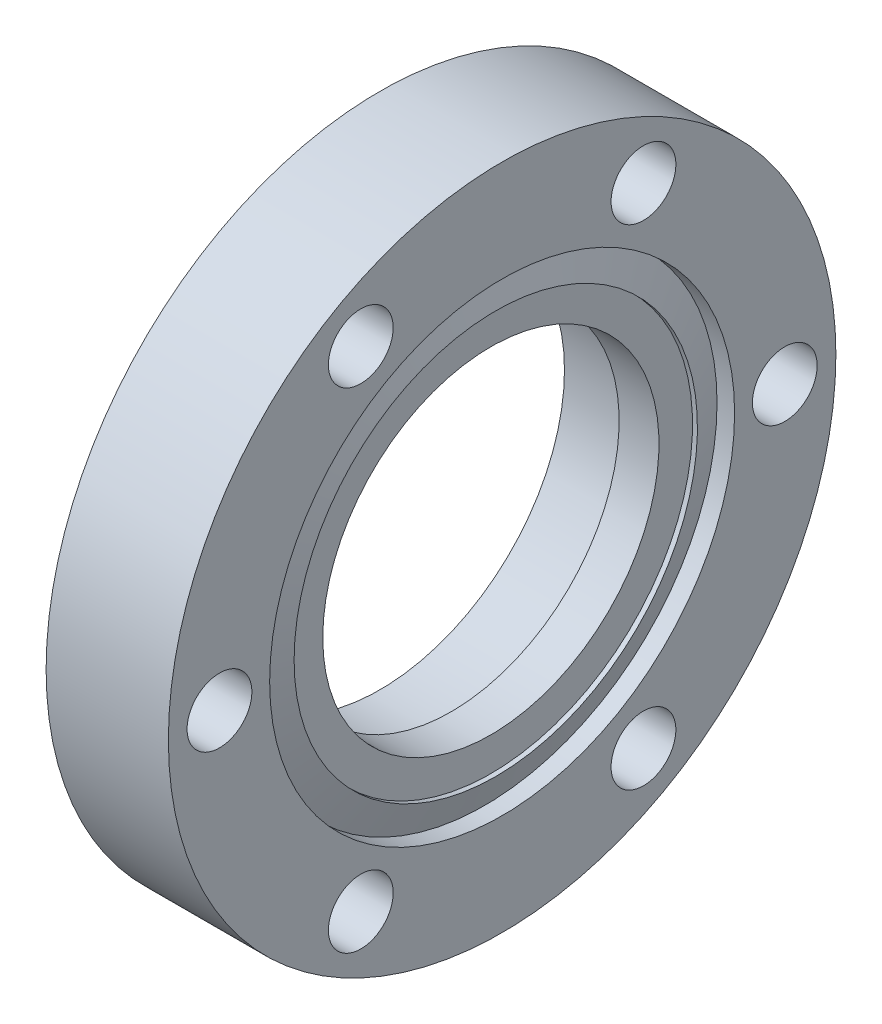
ISO-10303-21;
HEADER;
FILE_DESCRIPTION(('STEP AP214'),'2;1');
FILE_NAME('part.step','',(''),(''),'','','');
FILE_SCHEMA(('AUTOMOTIVE_DESIGN { 1 0 10303 214 1 1 1 1 }'));
ENDSEC;
DATA;
#1=APPLICATION_CONTEXT('core data for automotive mechanical design processes');
#2=APPLICATION_PROTOCOL_DEFINITION('international standard','automotive_design',2000,#1);
#3=PRODUCT_CONTEXT('',#1,'mechanical');
#4=PRODUCT('Part','Part','',(#3));
#5=PRODUCT_RELATED_PRODUCT_CATEGORY('part','',(#4));
#6=PRODUCT_DEFINITION_FORMATION('','',#4);
#7=PRODUCT_DEFINITION_CONTEXT('part definition',#1,'design');
#8=PRODUCT_DEFINITION('design','',#6,#7);
#9=PRODUCT_DEFINITION_SHAPE('','',#8);
#10=(LENGTH_UNIT() NAMED_UNIT(*) SI_UNIT(.MILLI.,.METRE.));
#11=(NAMED_UNIT(*) PLANE_ANGLE_UNIT() SI_UNIT($,.RADIAN.));
#12=(NAMED_UNIT(*) SI_UNIT($,.STERADIAN.) SOLID_ANGLE_UNIT());
#13=UNCERTAINTY_MEASURE_WITH_UNIT(LENGTH_MEASURE(1.E-05),#10,'distance_accuracy_value','');
#14=(GEOMETRIC_REPRESENTATION_CONTEXT(3) GLOBAL_UNCERTAINTY_ASSIGNED_CONTEXT((#13)) GLOBAL_UNIT_ASSIGNED_CONTEXT((#10,
#11,#12)) REPRESENTATION_CONTEXT('',''));
#15=CARTESIAN_POINT('',(0.,0.,0.));
#16=DIRECTION('',(0.,0.,1.));
#17=DIRECTION('',(1.,0.,0.));
#18=AXIS2_PLACEMENT_3D('',#15,#16,#17);
#19=CARTESIAN_POINT('',(5.18000000000051,-19.2062500000005,0.));
#20=DIRECTION('',(1.,0.,0.));
#21=DIRECTION('',(0.,0.,-1.));
#22=AXIS2_PLACEMENT_3D('',#19,#20,#21);
#23=PLANE('',#22);
#24=CARTESIAN_POINT('',(5.18000000000051,0.,0.));
#25=DIRECTION('',(-1.,0.,0.));
#26=DIRECTION('',(0.,0.,1.));
#27=AXIS2_PLACEMENT_3D('',#24,#25,#26);
#28=CIRCLE('',#27,17.4625);
#29=CARTESIAN_POINT('',(5.18000000000051,0.,17.4625));
#30=VERTEX_POINT('',#29);
#31=EDGE_CURVE('E18',#30,#30,#28,.T.);
#32=ORIENTED_EDGE('',*,*,#31,.T.);
#33=EDGE_LOOP('',(#32));
#34=FACE_BOUND('',#33,.T.);
#35=CARTESIAN_POINT('',(5.18000000000051,0.,0.));
#36=DIRECTION('',(-1.,0.,0.));
#37=DIRECTION('',(0.,0.,1.));
#38=AXIS2_PLACEMENT_3D('',#35,#36,#37);
#39=CIRCLE('',#38,20.950000000001);
#40=CARTESIAN_POINT('',(5.18000000000051,0.,20.950000000001));
#41=VERTEX_POINT('',#40);
#42=EDGE_CURVE('E81',#41,#41,#39,.F.);
#43=ORIENTED_EDGE('',*,*,#42,.T.);
#44=EDGE_LOOP('',(#43));
#45=FACE_BOUND('',#44,.T.);
#46=ADVANCED_FACE('F14',(#34,#45),#23,.T.);
#47=CARTESIAN_POINT('',(3.11069999999995,0.,0.));
#48=DIRECTION('',(-1.,0.,0.));
#49=DIRECTION('',(0.,0.,1.));
#50=AXIS2_PLACEMENT_3D('',#47,#48,#49);
#51=CYLINDRICAL_SURFACE('',#50,17.4625);
#52=CARTESIAN_POINT('',(1.04139999999939,0.,0.));
#53=DIRECTION('',(-1.,0.,0.));
#54=DIRECTION('',(0.,0.,1.));
#55=AXIS2_PLACEMENT_3D('',#52,#53,#54);
#56=CIRCLE('',#55,17.4625);
#57=CARTESIAN_POINT('',(1.04139999999939,0.,17.4625));
#58=VERTEX_POINT('',#57);
#59=EDGE_CURVE('E79',#58,#58,#56,.F.);
#60=ORIENTED_EDGE('',*,*,#59,.F.);
#61=EDGE_LOOP('',(#60));
#62=FACE_BOUND('',#61,.T.);
#63=ORIENTED_EDGE('',*,*,#31,.F.);
#64=EDGE_LOOP('',(#63));
#65=FACE_BOUND('',#64,.T.);
#66=ADVANCED_FACE('F89',(#62,#65),#51,.F.);
#67=CARTESIAN_POINT('',(5.43499999999988,0.,0.));
#68=DIRECTION('',(-1.,0.,0.));
#69=DIRECTION('',(0.,0.,1.));
#70=AXIS2_PLACEMENT_3D('',#67,#68,#69);
#71=CYLINDRICAL_SURFACE('',#70,20.950000000001);
#72=ORIENTED_EDGE('',*,*,#42,.F.);
#73=EDGE_LOOP('',(#72));
#74=FACE_BOUND('',#73,.T.);
#75=CARTESIAN_POINT('',(5.69000000223288,0.,0.));
#76=DIRECTION('',(-1.,0.,0.));
#77=DIRECTION('',(0.,-1.,0.));
#78=AXIS2_PLACEMENT_3D('',#75,#76,#77);
#79=CIRCLE('',#78,20.950000000814);
#80=CARTESIAN_POINT('',(5.69000000223288,-20.950000000814,0.));
#81=VERTEX_POINT('',#80);
#82=EDGE_CURVE('E78',#81,#81,#79,.T.);
#83=ORIENTED_EDGE('',*,*,#82,.F.);
#84=EDGE_LOOP('',(#83));
#85=FACE_BOUND('',#84,.T.);
#86=ADVANCED_FACE('F91',(#74,#85),#71,.F.);
#87=CARTESIAN_POINT('',(1.04139999999939,-18.3197499999999,0.));
#88=DIRECTION('',(-1.,0.,0.));
#89=DIRECTION('',(0.,0.,1.));
#90=AXIS2_PLACEMENT_3D('',#87,#88,#89);
#91=PLANE('',#90);
#92=ORIENTED_EDGE('',*,*,#59,.T.);
#93=EDGE_LOOP('',(#92));
#94=FACE_BOUND('',#93,.T.);
#95=CARTESIAN_POINT('',(1.04139999999939,0.,0.));
#96=DIRECTION('',(-1.,0.,0.));
#97=DIRECTION('',(0.,0.,1.));
#98=AXIS2_PLACEMENT_3D('',#95,#96,#97);
#99=CIRCLE('',#98,19.1769999999999);
#100=CARTESIAN_POINT('',(1.04139999999939,0.,19.1769999999999));
#101=VERTEX_POINT('',#100);
#102=EDGE_CURVE('E75',#101,#101,#99,.T.);
#103=ORIENTED_EDGE('',*,*,#102,.T.);
#104=EDGE_LOOP('',(#103));
#105=FACE_BOUND('',#104,.T.);
#106=ADVANCED_FACE('F100',(#94,#105),#91,.T.);
#107=CARTESIAN_POINT('',(4.52529524811392,0.,0.));
#108=DIRECTION('',(-1.,0.,0.));
#109=DIRECTION('',(0.,0.,1.));
#110=AXIS2_PLACEMENT_3D('',#107,#108,#109);
#111=CONICAL_SURFACE('',#110,24.1499999991873,1.22173047499998);
#112=ORIENTED_EDGE('',*,*,#82,.T.);
#113=EDGE_LOOP('',(#112));
#114=FACE_BOUND('',#113,.T.);
#115=CARTESIAN_POINT('',(4.52529525034756,0.,0.));
#116=DIRECTION('',(-1.,0.,0.));
#117=DIRECTION('',(0.,0.,1.));
#118=AXIS2_PLACEMENT_3D('',#115,#116,#117);
#119=CIRCLE('',#118,24.1500000000003);
#120=CARTESIAN_POINT('',(4.52529525034756,0.,24.1500000000003));
#121=VERTEX_POINT('',#120);
#122=EDGE_CURVE('E74',#121,#121,#119,.F.);
#123=ORIENTED_EDGE('',*,*,#122,.T.);
#124=EDGE_LOOP('',(#123));
#125=FACE_BOUND('',#124,.T.);
#126=ADVANCED_FACE('F130',(#114,#125),#111,.T.);
#127=CARTESIAN_POINT('',(-2.65429999999995,0.,0.));
#128=DIRECTION('',(-1.,0.,0.));
#129=DIRECTION('',(0.,0.,1.));
#130=AXIS2_PLACEMENT_3D('',#127,#128,#129);
#131=CYLINDRICAL_SURFACE('',#130,19.1769999999999);
#132=CARTESIAN_POINT('',(-6.34999999999929,0.,0.));
#133=DIRECTION('',(-1.,0.,0.));
#134=DIRECTION('',(0.,0.,1.));
#135=AXIS2_PLACEMENT_3D('',#132,#133,#134);
#136=CIRCLE('',#135,19.1769999999999);
#137=CARTESIAN_POINT('',(-6.34999999999929,0.,19.1769999999999));
#138=VERTEX_POINT('',#137);
#139=EDGE_CURVE('E53',#138,#138,#136,.F.);
#140=ORIENTED_EDGE('',*,*,#139,.F.);
#141=EDGE_LOOP('',(#140));
#142=FACE_BOUND('',#141,.T.);
#143=ORIENTED_EDGE('',*,*,#102,.F.);
#144=EDGE_LOOP('',(#143));
#145=FACE_BOUND('',#144,.T.);
#146=ADVANCED_FACE('F126',(#142,#145),#131,.F.);
#147=CARTESIAN_POINT('',(6.34999999999939,-25.4285843160799,14.6811999999998));
#148=DIRECTION('',(-1.,0.,0.));
#149=DIRECTION('',(0.,0.,1.));
#150=AXIS2_PLACEMENT_3D('',#147,#148,#149);
#151=CYLINDRICAL_SURFACE('',#150,3.36550000000002);
#152=CARTESIAN_POINT('',(6.34999999999937,-25.4285843160799,14.6811999999998));
#153=DIRECTION('',(-1.,0.,0.));
#154=DIRECTION('',(0.,0.,1.));
#155=AXIS2_PLACEMENT_3D('',#152,#153,#154);
#156=CIRCLE('',#155,3.36550000000002);
#157=CARTESIAN_POINT('',(6.34999999999937,-25.4285843160799,18.0466999999999));
#158=VERTEX_POINT('',#157);
#159=EDGE_CURVE('E50',#158,#158,#156,.T.);
#160=ORIENTED_EDGE('',*,*,#159,.F.);
#161=EDGE_LOOP('',(#160));
#162=FACE_BOUND('',#161,.T.);
#163=CARTESIAN_POINT('',(-6.34999999999929,-25.4285843160799,14.6811999999998));
#164=DIRECTION('',(-1.,0.,0.));
#165=DIRECTION('',(0.,0.,1.));
#166=AXIS2_PLACEMENT_3D('',#163,#164,#165);
#167=CIRCLE('',#166,3.36550000000002);
#168=CARTESIAN_POINT('',(-6.34999999999929,-25.4285843160799,18.0466999999999));
#169=VERTEX_POINT('',#168);
#170=EDGE_CURVE('E71',#169,#169,#167,.F.);
#171=ORIENTED_EDGE('',*,*,#170,.F.);
#172=EDGE_LOOP('',(#171));
#173=FACE_BOUND('',#172,.T.);
#174=ADVANCED_FACE('F129',(#162,#173),#151,.F.);
#175=CARTESIAN_POINT('',(6.34999999999939,0.,29.3623999999996));
#176=DIRECTION('',(-1.,0.,0.));
#177=DIRECTION('',(0.,0.,1.));
#178=AXIS2_PLACEMENT_3D('',#175,#176,#177);
#179=CYLINDRICAL_SURFACE('',#178,3.3655);
#180=CARTESIAN_POINT('',(6.34999999999937,0.,29.3623999999996));
#181=DIRECTION('',(-1.,0.,0.));
#182=DIRECTION('',(0.,0.,1.));
#183=AXIS2_PLACEMENT_3D('',#180,#181,#182);
#184=CIRCLE('',#183,3.3655);
#185=CARTESIAN_POINT('',(6.34999999999937,0.,32.7278999999996));
#186=VERTEX_POINT('',#185);
#187=EDGE_CURVE('E47',#186,#186,#184,.T.);
#188=ORIENTED_EDGE('',*,*,#187,.F.);
#189=EDGE_LOOP('',(#188));
#190=FACE_BOUND('',#189,.T.);
#191=CARTESIAN_POINT('',(-6.34999999999929,0.,29.3623999999996));
#192=DIRECTION('',(-1.,0.,0.));
#193=DIRECTION('',(0.,0.,1.));
#194=AXIS2_PLACEMENT_3D('',#191,#192,#193);
#195=CIRCLE('',#194,3.3655);
#196=CARTESIAN_POINT('',(-6.34999999999929,0.,32.7278999999996));
#197=VERTEX_POINT('',#196);
#198=EDGE_CURVE('E68',#197,#197,#195,.F.);
#199=ORIENTED_EDGE('',*,*,#198,.F.);
#200=EDGE_LOOP('',(#199));
#201=FACE_BOUND('',#200,.T.);
#202=ADVANCED_FACE('F213',(#190,#201),#179,.F.);
#203=CARTESIAN_POINT('',(6.34999999999939,25.4285843160799,14.6811999999998));
#204=DIRECTION('',(-1.,0.,0.));
#205=DIRECTION('',(0.,0.,1.));
#206=AXIS2_PLACEMENT_3D('',#203,#204,#205);
#207=CYLINDRICAL_SURFACE('',#206,3.36549999999999);
#208=CARTESIAN_POINT('',(6.34999999999937,25.4285843160799,14.6811999999998));
#209=DIRECTION('',(-1.,0.,0.));
#210=DIRECTION('',(0.,0.,1.));
#211=AXIS2_PLACEMENT_3D('',#208,#209,#210);
#212=CIRCLE('',#211,3.36549999999999);
#213=CARTESIAN_POINT('',(6.34999999999937,25.4285843160799,18.0466999999998));
#214=VERTEX_POINT('',#213);
#215=EDGE_CURVE('E44',#214,#214,#212,.T.);
#216=ORIENTED_EDGE('',*,*,#215,.F.);
#217=EDGE_LOOP('',(#216));
#218=FACE_BOUND('',#217,.T.);
#219=CARTESIAN_POINT('',(-6.34999999999929,25.4285843160799,14.6811999999998));
#220=DIRECTION('',(-1.,0.,0.));
#221=DIRECTION('',(0.,0.,1.));
#222=AXIS2_PLACEMENT_3D('',#219,#220,#221);
#223=CIRCLE('',#222,3.36549999999999);
#224=CARTESIAN_POINT('',(-6.34999999999929,25.4285843160799,18.0466999999998));
#225=VERTEX_POINT('',#224);
#226=EDGE_CURVE('E65',#225,#225,#223,.F.);
#227=ORIENTED_EDGE('',*,*,#226,.F.);
#228=EDGE_LOOP('',(#227));
#229=FACE_BOUND('',#228,.T.);
#230=ADVANCED_FACE('F224',(#218,#229),#207,.F.);
#231=CARTESIAN_POINT('',(6.34999999999939,25.4285843160799,-14.6811999999998));
#232=DIRECTION('',(-1.,0.,0.));
#233=DIRECTION('',(0.,0.,1.));
#234=AXIS2_PLACEMENT_3D('',#231,#232,#233);
#235=CYLINDRICAL_SURFACE('',#234,3.3655);
#236=CARTESIAN_POINT('',(6.34999999999937,25.4285843160799,-14.6811999999998));
#237=DIRECTION('',(-1.,0.,0.));
#238=DIRECTION('',(0.,0.,1.));
#239=AXIS2_PLACEMENT_3D('',#236,#237,#238);
#240=CIRCLE('',#239,3.3655);
#241=CARTESIAN_POINT('',(6.34999999999937,25.4285843160799,-11.3156999999998));
#242=VERTEX_POINT('',#241);
#243=EDGE_CURVE('E41',#242,#242,#240,.T.);
#244=ORIENTED_EDGE('',*,*,#243,.F.);
#245=EDGE_LOOP('',(#244));
#246=FACE_BOUND('',#245,.T.);
#247=CARTESIAN_POINT('',(-6.34999999999929,25.4285843160799,-14.6811999999998));
#248=DIRECTION('',(-1.,0.,0.));
#249=DIRECTION('',(0.,0.,1.));
#250=AXIS2_PLACEMENT_3D('',#247,#248,#249);
#251=CIRCLE('',#250,3.3655);
#252=CARTESIAN_POINT('',(-6.34999999999929,25.4285843160799,-11.3156999999998));
#253=VERTEX_POINT('',#252);
#254=EDGE_CURVE('E62',#253,#253,#251,.F.);
#255=ORIENTED_EDGE('',*,*,#254,.F.);
#256=EDGE_LOOP('',(#255));
#257=FACE_BOUND('',#256,.T.);
#258=ADVANCED_FACE('F235',(#246,#257),#235,.F.);
#259=CARTESIAN_POINT('',(6.34999999999939,-25.4285843160799,-14.6811999999998));
#260=DIRECTION('',(-1.,0.,0.));
#261=DIRECTION('',(0.,0.,1.));
#262=AXIS2_PLACEMENT_3D('',#259,#260,#261);
#263=CYLINDRICAL_SURFACE('',#262,3.3655);
#264=CARTESIAN_POINT('',(6.34999999999937,-25.4285843160799,-14.6811999999998));
#265=DIRECTION('',(-1.,0.,0.));
#266=DIRECTION('',(0.,0.,1.));
#267=AXIS2_PLACEMENT_3D('',#264,#265,#266);
#268=CIRCLE('',#267,3.3655);
#269=CARTESIAN_POINT('',(6.34999999999937,-25.4285843160799,-11.3156999999998));
#270=VERTEX_POINT('',#269);
#271=EDGE_CURVE('E38',#270,#270,#268,.T.);
#272=ORIENTED_EDGE('',*,*,#271,.F.);
#273=EDGE_LOOP('',(#272));
#274=FACE_BOUND('',#273,.T.);
#275=CARTESIAN_POINT('',(-6.34999999999929,-25.4285843160799,-14.6811999999998));
#276=DIRECTION('',(-1.,0.,0.));
#277=DIRECTION('',(0.,0.,1.));
#278=AXIS2_PLACEMENT_3D('',#275,#276,#277);
#279=CIRCLE('',#278,3.3655);
#280=CARTESIAN_POINT('',(-6.34999999999929,-25.4285843160799,-11.3156999999998));
#281=VERTEX_POINT('',#280);
#282=EDGE_CURVE('E59',#281,#281,#279,.F.);
#283=ORIENTED_EDGE('',*,*,#282,.F.);
#284=EDGE_LOOP('',(#283));
#285=FACE_BOUND('',#284,.T.);
#286=ADVANCED_FACE('F246',(#274,#285),#263,.F.);
#287=CARTESIAN_POINT('',(6.34999999999939,0.,-29.3623999999996));
#288=DIRECTION('',(-1.,0.,0.));
#289=DIRECTION('',(0.,0.,1.));
#290=AXIS2_PLACEMENT_3D('',#287,#288,#289);
#291=CYLINDRICAL_SURFACE('',#290,3.3655);
#292=CARTESIAN_POINT('',(6.34999999999937,0.,-29.3623999999996));
#293=DIRECTION('',(-1.,0.,0.));
#294=DIRECTION('',(0.,0.,1.));
#295=AXIS2_PLACEMENT_3D('',#292,#293,#294);
#296=CIRCLE('',#295,3.3655);
#297=CARTESIAN_POINT('',(6.34999999999937,0.,-25.9968999999996));
#298=VERTEX_POINT('',#297);
#299=EDGE_CURVE('E35',#298,#298,#296,.T.);
#300=ORIENTED_EDGE('',*,*,#299,.F.);
#301=EDGE_LOOP('',(#300));
#302=FACE_BOUND('',#301,.T.);
#303=CARTESIAN_POINT('',(-6.34999999999929,0.,-29.3623999999996));
#304=DIRECTION('',(-1.,0.,0.));
#305=DIRECTION('',(0.,0.,1.));
#306=AXIS2_PLACEMENT_3D('',#303,#304,#305);
#307=CIRCLE('',#306,3.3655);
#308=CARTESIAN_POINT('',(-6.34999999999929,0.,-25.9968999999996));
#309=VERTEX_POINT('',#308);
#310=EDGE_CURVE('E56',#309,#309,#307,.F.);
#311=ORIENTED_EDGE('',*,*,#310,.F.);
#312=EDGE_LOOP('',(#311));
#313=FACE_BOUND('',#312,.T.);
#314=ADVANCED_FACE('F16',(#302,#313),#291,.F.);
#315=CARTESIAN_POINT('',(5.43764762517347,0.,0.));
#316=DIRECTION('',(-1.,0.,0.));
#317=DIRECTION('',(0.,0.,1.));
#318=AXIS2_PLACEMENT_3D('',#315,#316,#317);
#319=CYLINDRICAL_SURFACE('',#318,24.1500000000003);
#320=ORIENTED_EDGE('',*,*,#122,.F.);
#321=EDGE_LOOP('',(#320));
#322=FACE_BOUND('',#321,.T.);
#323=CARTESIAN_POINT('',(6.34999999999937,0.,0.));
#324=DIRECTION('',(-1.,0.,0.));
#325=DIRECTION('',(0.,0.,1.));
#326=AXIS2_PLACEMENT_3D('',#323,#324,#325);
#327=CIRCLE('',#326,24.1500000000003);
#328=CARTESIAN_POINT('',(6.34999999999937,0.,24.1500000000003));
#329=VERTEX_POINT('',#328);
#330=EDGE_CURVE('E27',#329,#329,#327,.T.);
#331=ORIENTED_EDGE('',*,*,#330,.F.);
#332=EDGE_LOOP('',(#331));
#333=FACE_BOUND('',#332,.T.);
#334=ADVANCED_FACE('F121',(#322,#333),#319,.F.);
#335=CARTESIAN_POINT('',(-6.34999999999929,-26.9240000000001,0.));
#336=DIRECTION('',(-1.,0.,0.));
#337=DIRECTION('',(0.,0.,1.));
#338=AXIS2_PLACEMENT_3D('',#335,#336,#337);
#339=PLANE('',#338);
#340=ORIENTED_EDGE('',*,*,#139,.T.);
#341=EDGE_LOOP('',(#340));
#342=FACE_BOUND('',#341,.T.);
#343=ORIENTED_EDGE('',*,*,#310,.T.);
#344=EDGE_LOOP('',(#343));
#345=FACE_BOUND('',#344,.T.);
#346=ORIENTED_EDGE('',*,*,#282,.T.);
#347=EDGE_LOOP('',(#346));
#348=FACE_BOUND('',#347,.T.);
#349=ORIENTED_EDGE('',*,*,#254,.T.);
#350=EDGE_LOOP('',(#349));
#351=FACE_BOUND('',#350,.T.);
#352=ORIENTED_EDGE('',*,*,#226,.T.);
#353=EDGE_LOOP('',(#352));
#354=FACE_BOUND('',#353,.T.);
#355=ORIENTED_EDGE('',*,*,#198,.T.);
#356=EDGE_LOOP('',(#355));
#357=FACE_BOUND('',#356,.T.);
#358=ORIENTED_EDGE('',*,*,#170,.T.);
#359=EDGE_LOOP('',(#358));
#360=FACE_BOUND('',#359,.T.);
#361=CARTESIAN_POINT('',(-6.34999999999929,0.,0.));
#362=DIRECTION('',(-1.,0.,0.));
#363=DIRECTION('',(0.,0.,1.));
#364=AXIS2_PLACEMENT_3D('',#361,#362,#363);
#365=CIRCLE('',#364,34.6710000000003);
#366=CARTESIAN_POINT('',(-6.34999999999929,0.,34.6710000000003));
#367=VERTEX_POINT('',#366);
#368=EDGE_CURVE('E22',#367,#367,#365,.F.);
#369=ORIENTED_EDGE('',*,*,#368,.F.);
#370=EDGE_LOOP('',(#369));
#371=FACE_BOUND('',#370,.T.);
#372=ADVANCED_FACE('F114',(#342,#345,#348,#351,#354,#357,#360,#371),#339,.T.);
#373=CARTESIAN_POINT('',(6.34999999999937,-29.4105000000003,0.));
#374=DIRECTION('',(1.,0.,0.));
#375=DIRECTION('',(0.,0.,-1.));
#376=AXIS2_PLACEMENT_3D('',#373,#374,#375);
#377=PLANE('',#376);
#378=ORIENTED_EDGE('',*,*,#330,.T.);
#379=EDGE_LOOP('',(#378));
#380=FACE_BOUND('',#379,.T.);
#381=ORIENTED_EDGE('',*,*,#299,.T.);
#382=EDGE_LOOP('',(#381));
#383=FACE_BOUND('',#382,.T.);
#384=ORIENTED_EDGE('',*,*,#271,.T.);
#385=EDGE_LOOP('',(#384));
#386=FACE_BOUND('',#385,.T.);
#387=ORIENTED_EDGE('',*,*,#243,.T.);
#388=EDGE_LOOP('',(#387));
#389=FACE_BOUND('',#388,.T.);
#390=ORIENTED_EDGE('',*,*,#215,.T.);
#391=EDGE_LOOP('',(#390));
#392=FACE_BOUND('',#391,.T.);
#393=ORIENTED_EDGE('',*,*,#187,.T.);
#394=EDGE_LOOP('',(#393));
#395=FACE_BOUND('',#394,.T.);
#396=ORIENTED_EDGE('',*,*,#159,.T.);
#397=EDGE_LOOP('',(#396));
#398=FACE_BOUND('',#397,.T.);
#399=CARTESIAN_POINT('',(6.34999999999937,0.,0.));
#400=DIRECTION('',(-1.,0.,0.));
#401=DIRECTION('',(0.,0.,1.));
#402=AXIS2_PLACEMENT_3D('',#399,#400,#401);
#403=CIRCLE('',#402,34.6710000000003);
#404=CARTESIAN_POINT('',(6.34999999999937,0.,34.6710000000003));
#405=VERTEX_POINT('',#404);
#406=EDGE_CURVE('E10',#405,#405,#403,.T.);
#407=ORIENTED_EDGE('',*,*,#406,.F.);
#408=EDGE_LOOP('',(#407));
#409=FACE_BOUND('',#408,.T.);
#410=ADVANCED_FACE('F107',(#380,#383,#386,#389,#392,#395,#398,#409),#377,.T.);
#411=CARTESIAN_POINT('',(0.,0.,0.));
#412=DIRECTION('',(-1.,0.,0.));
#413=DIRECTION('',(0.,0.,1.));
#414=AXIS2_PLACEMENT_3D('',#411,#412,#413);
#415=CYLINDRICAL_SURFACE('',#414,34.6710000000003);
#416=ORIENTED_EDGE('',*,*,#406,.T.);
#417=EDGE_LOOP('',(#416));
#418=FACE_BOUND('',#417,.T.);
#419=ORIENTED_EDGE('',*,*,#368,.T.);
#420=EDGE_LOOP('',(#419));
#421=FACE_BOUND('',#420,.T.);
#422=ADVANCED_FACE('F105',(#418,#421),#415,.T.);
#423=CLOSED_SHELL('',(#46,#66,#86,#106,#126,#146,#174,#202,#230,#258,#286,#314,#334,#372,#410,#422));
#424=MANIFOLD_SOLID_BREP('B1',#423);
#425=ADVANCED_BREP_SHAPE_REPRESENTATION('',(#18,#424),#14);
#426=SHAPE_DEFINITION_REPRESENTATION(#9,#425);
ENDSEC;
END-ISO-10303-21;
